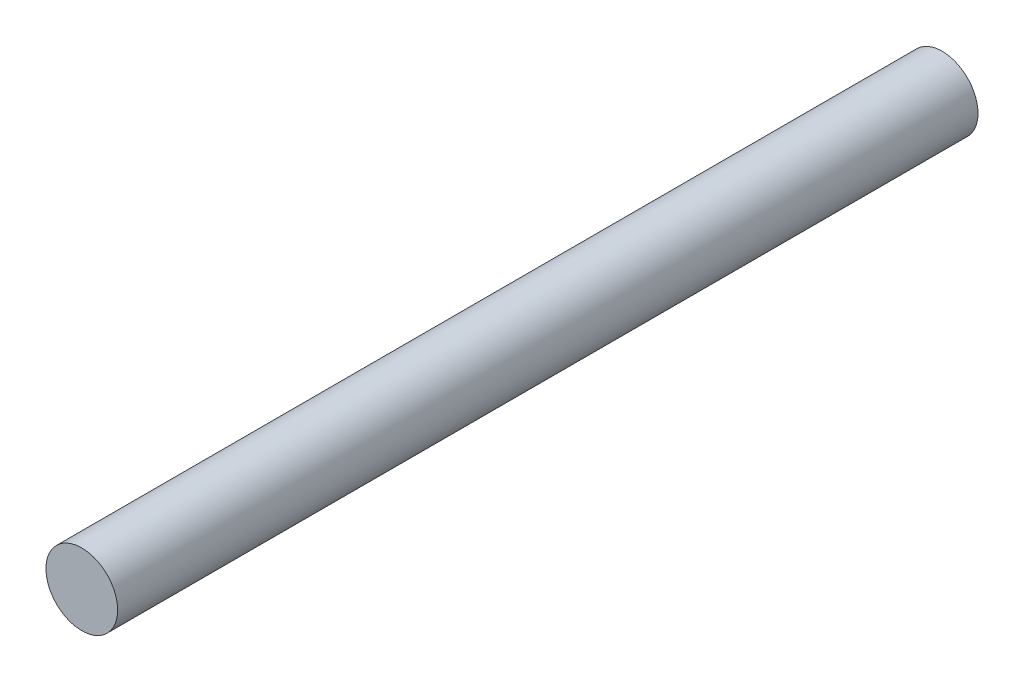
ISO-10303-21;
HEADER;
FILE_DESCRIPTION(('STEP AP214'),'2;1');
FILE_NAME('part.step','',(''),(''),'','','');
FILE_SCHEMA(('AUTOMOTIVE_DESIGN { 1 0 10303 214 1 1 1 1 }'));
ENDSEC;
DATA;
#1=APPLICATION_CONTEXT('core data for automotive mechanical design processes');
#2=APPLICATION_PROTOCOL_DEFINITION('international standard','automotive_design',2000,#1);
#3=PRODUCT_CONTEXT('',#1,'mechanical');
#4=PRODUCT('Part','Part','',(#3));
#5=PRODUCT_RELATED_PRODUCT_CATEGORY('part','',(#4));
#6=PRODUCT_DEFINITION_FORMATION('','',#4);
#7=PRODUCT_DEFINITION_CONTEXT('part definition',#1,'design');
#8=PRODUCT_DEFINITION('design','',#6,#7);
#9=PRODUCT_DEFINITION_SHAPE('','',#8);
#10=(LENGTH_UNIT() NAMED_UNIT(*) SI_UNIT(.MILLI.,.METRE.));
#11=(NAMED_UNIT(*) PLANE_ANGLE_UNIT() SI_UNIT($,.RADIAN.));
#12=(NAMED_UNIT(*) SI_UNIT($,.STERADIAN.) SOLID_ANGLE_UNIT());
#13=UNCERTAINTY_MEASURE_WITH_UNIT(LENGTH_MEASURE(1.E-05),#10,'distance_accuracy_value','');
#14=(GEOMETRIC_REPRESENTATION_CONTEXT(3) GLOBAL_UNCERTAINTY_ASSIGNED_CONTEXT((#13)) GLOBAL_UNIT_ASSIGNED_CONTEXT((#10,
#11,#12)) REPRESENTATION_CONTEXT('',''));
#15=CARTESIAN_POINT('',(0.,0.,0.));
#16=DIRECTION('',(0.,0.,1.));
#17=DIRECTION('',(1.,0.,0.));
#18=AXIS2_PLACEMENT_3D('',#15,#16,#17);
#19=CARTESIAN_POINT('',(0.,0.,90.));
#20=DIRECTION('',(0.,0.,-1.));
#21=DIRECTION('',(-1.,0.,0.));
#22=AXIS2_PLACEMENT_3D('',#19,#20,#21);
#23=CYLINDRICAL_SURFACE('',#22,3.75);
#24=CARTESIAN_POINT('',(0.,0.,90.));
#25=DIRECTION('',(0.,0.,1.));
#26=DIRECTION('',(1.,0.,0.));
#27=AXIS2_PLACEMENT_3D('',#24,#25,#26);
#28=CIRCLE('',#27,3.75);
#29=CARTESIAN_POINT('',(3.75,0.,90.));
#30=VERTEX_POINT('',#29);
#31=EDGE_CURVE('E10',#30,#30,#28,.T.);
#32=ORIENTED_EDGE('',*,*,#31,.F.);
#33=EDGE_LOOP('',(#32));
#34=FACE_BOUND('',#33,.T.);
#35=CARTESIAN_POINT('',(0.,0.,0.));
#36=DIRECTION('',(0.,0.,1.));
#37=DIRECTION('',(1.,0.,0.));
#38=AXIS2_PLACEMENT_3D('',#35,#36,#37);
#39=CIRCLE('',#38,3.75);
#40=CARTESIAN_POINT('',(3.75,0.,0.));
#41=VERTEX_POINT('',#40);
#42=EDGE_CURVE('E34',#41,#41,#39,.T.);
#43=ORIENTED_EDGE('',*,*,#42,.T.);
#44=EDGE_LOOP('',(#43));
#45=FACE_BOUND('',#44,.T.);
#46=ADVANCED_FACE('F31',(#34,#45),#23,.T.);
#47=CARTESIAN_POINT('',(0.,0.,90.));
#48=DIRECTION('',(0.,0.,1.));
#49=DIRECTION('',(1.,0.,0.));
#50=AXIS2_PLACEMENT_3D('',#47,#48,#49);
#51=PLANE('',#50);
#52=ORIENTED_EDGE('',*,*,#31,.T.);
#53=EDGE_LOOP('',(#52));
#54=FACE_BOUND('',#53,.T.);
#55=ADVANCED_FACE('F46',(#54),#51,.T.);
#56=CARTESIAN_POINT('',(0.,0.,0.));
#57=DIRECTION('',(0.,0.,1.));
#58=DIRECTION('',(1.,0.,0.));
#59=AXIS2_PLACEMENT_3D('',#56,#57,#58);
#60=PLANE('',#59);
#61=ORIENTED_EDGE('',*,*,#42,.F.);
#62=EDGE_LOOP('',(#61));
#63=FACE_BOUND('',#62,.T.);
#64=ADVANCED_FACE('F44',(#63),#60,.F.);
#65=CLOSED_SHELL('',(#46,#55,#64));
#66=MANIFOLD_SOLID_BREP('B2',#65);
#67=ADVANCED_BREP_SHAPE_REPRESENTATION('',(#18,#66),#14);
#68=SHAPE_DEFINITION_REPRESENTATION(#9,#67);
ENDSEC;
END-ISO-10303-21;
